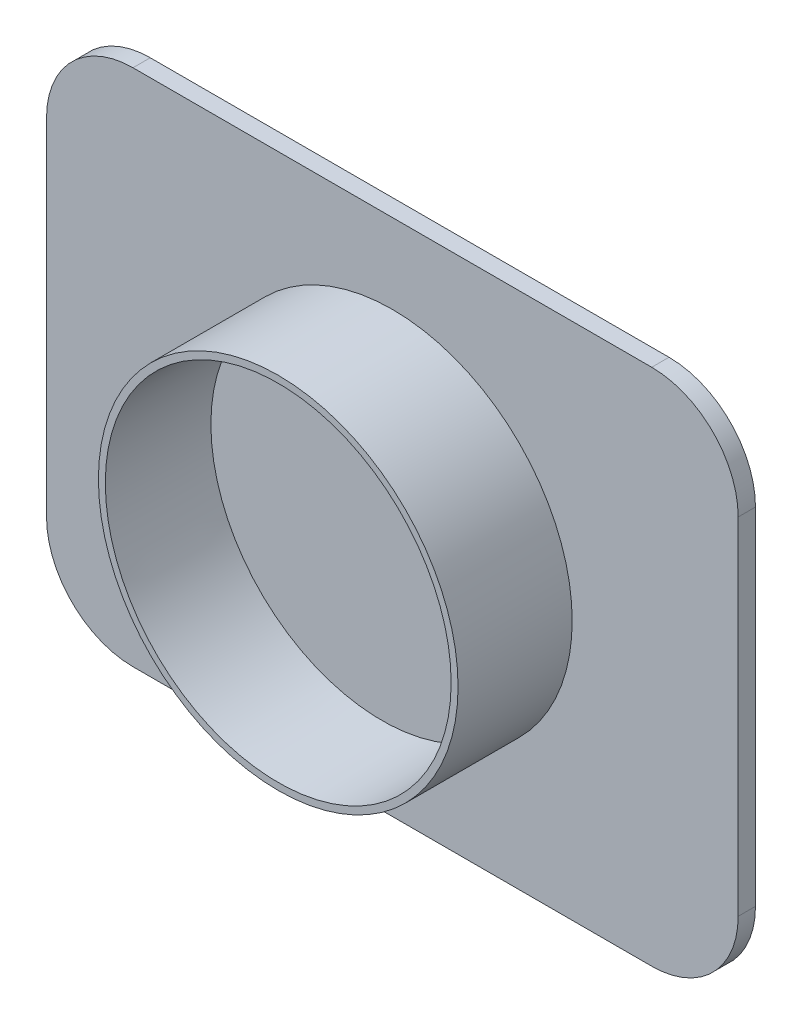
ISO-10303-21;
HEADER;
FILE_DESCRIPTION(('STEP AP214'),'2;1');
FILE_NAME('part.step','',(''),(''),'','','');
FILE_SCHEMA(('AUTOMOTIVE_DESIGN { 1 0 10303 214 1 1 1 1 }'));
ENDSEC;
DATA;
#1=APPLICATION_CONTEXT('core data for automotive mechanical design processes');
#2=APPLICATION_PROTOCOL_DEFINITION('international standard','automotive_design',2000,#1);
#3=PRODUCT_CONTEXT('',#1,'mechanical');
#4=PRODUCT('Part','Part','',(#3));
#5=PRODUCT_RELATED_PRODUCT_CATEGORY('part','',(#4));
#6=PRODUCT_DEFINITION_FORMATION('','',#4);
#7=PRODUCT_DEFINITION_CONTEXT('part definition',#1,'design');
#8=PRODUCT_DEFINITION('design','',#6,#7);
#9=PRODUCT_DEFINITION_SHAPE('','',#8);
#10=(LENGTH_UNIT() NAMED_UNIT(*) SI_UNIT(.MILLI.,.METRE.));
#11=(NAMED_UNIT(*) PLANE_ANGLE_UNIT() SI_UNIT($,.RADIAN.));
#12=(NAMED_UNIT(*) SI_UNIT($,.STERADIAN.) SOLID_ANGLE_UNIT());
#13=UNCERTAINTY_MEASURE_WITH_UNIT(LENGTH_MEASURE(1.E-05),#10,'distance_accuracy_value','');
#14=(GEOMETRIC_REPRESENTATION_CONTEXT(3) GLOBAL_UNCERTAINTY_ASSIGNED_CONTEXT((#13)) GLOBAL_UNIT_ASSIGNED_CONTEXT((#10,
#11,#12)) REPRESENTATION_CONTEXT('',''));
#15=CARTESIAN_POINT('',(0.,0.,0.));
#16=DIRECTION('',(0.,0.,1.));
#17=DIRECTION('',(1.,0.,0.));
#18=AXIS2_PLACEMENT_3D('',#15,#16,#17);
#19=CARTESIAN_POINT('',(0.,0.,6.6));
#20=DIRECTION('',(0.,0.,-1.));
#21=DIRECTION('',(-1.,0.,0.));
#22=AXIS2_PLACEMENT_3D('',#19,#20,#21);
#23=CYLINDRICAL_SURFACE('',#22,10.4);
#24=CARTESIAN_POINT('',(0.,0.,6.6));
#25=DIRECTION('',(0.,0.,1.));
#26=DIRECTION('',(1.,0.,0.));
#27=AXIS2_PLACEMENT_3D('',#24,#25,#26);
#28=CIRCLE('',#27,10.4);
#29=CARTESIAN_POINT('',(10.4,0.,6.6));
#30=VERTEX_POINT('',#29);
#31=EDGE_CURVE('E124',#30,#30,#28,.T.);
#32=ORIENTED_EDGE('',*,*,#31,.F.);
#33=EDGE_LOOP('',(#32));
#34=FACE_BOUND('',#33,.T.);
#35=CARTESIAN_POINT('',(0.,0.,0.));
#36=DIRECTION('',(0.,0.,1.));
#37=DIRECTION('',(1.,0.,0.));
#38=AXIS2_PLACEMENT_3D('',#35,#36,#37);
#39=CIRCLE('',#38,10.4);
#40=CARTESIAN_POINT('',(10.4,0.,0.));
#41=VERTEX_POINT('',#40);
#42=EDGE_CURVE('E132',#41,#41,#39,.T.);
#43=ORIENTED_EDGE('',*,*,#42,.T.);
#44=EDGE_LOOP('',(#43));
#45=FACE_BOUND('',#44,.T.);
#46=ADVANCED_FACE('F35',(#34,#45),#23,.T.);
#47=CARTESIAN_POINT('',(0.,0.,6.6));
#48=DIRECTION('',(0.,0.,1.));
#49=DIRECTION('',(1.,0.,0.));
#50=AXIS2_PLACEMENT_3D('',#47,#48,#49);
#51=PLANE('',#50);
#52=CARTESIAN_POINT('',(0.,0.,6.6));
#53=DIRECTION('',(0.,0.,1.));
#54=DIRECTION('',(1.,0.,0.));
#55=AXIS2_PLACEMENT_3D('',#52,#53,#54);
#56=CIRCLE('',#55,10.);
#57=CARTESIAN_POINT('',(10.,0.,6.6));
#58=VERTEX_POINT('',#57);
#59=EDGE_CURVE('E179',#58,#58,#56,.T.);
#60=ORIENTED_EDGE('',*,*,#59,.F.);
#61=EDGE_LOOP('',(#60));
#62=FACE_BOUND('',#61,.T.);
#63=ORIENTED_EDGE('',*,*,#31,.T.);
#64=EDGE_LOOP('',(#63));
#65=FACE_BOUND('',#64,.T.);
#66=ADVANCED_FACE('F190',(#62,#65),#51,.T.);
#67=CARTESIAN_POINT('',(0.,0.,6.6));
#68=DIRECTION('',(0.,0.,1.));
#69=DIRECTION('',(1.,0.,0.));
#70=AXIS2_PLACEMENT_3D('',#67,#68,#69);
#71=CONICAL_SURFACE('',#70,10.,0.0174532925199433);
#72=CARTESIAN_POINT('',(0.,0.,0.6));
#73=DIRECTION('',(0.,0.,1.));
#74=DIRECTION('',(1.,0.,0.));
#75=AXIS2_PLACEMENT_3D('',#72,#73,#74);
#76=CIRCLE('',#75,9.89526961043069);
#77=CARTESIAN_POINT('',(9.89526961043069,0.,0.6));
#78=VERTEX_POINT('',#77);
#79=EDGE_CURVE('E129',#78,#78,#76,.T.);
#80=ORIENTED_EDGE('',*,*,#79,.F.);
#81=EDGE_LOOP('',(#80));
#82=FACE_BOUND('',#81,.T.);
#83=ORIENTED_EDGE('',*,*,#59,.T.);
#84=EDGE_LOOP('',(#83));
#85=FACE_BOUND('',#84,.T.);
#86=ADVANCED_FACE('F187',(#82,#85),#71,.F.);
#87=CARTESIAN_POINT('',(0.,0.,0.6));
#88=DIRECTION('',(0.,0.,1.));
#89=DIRECTION('',(1.,0.,0.));
#90=AXIS2_PLACEMENT_3D('',#87,#88,#89);
#91=PLANE('',#90);
#92=ORIENTED_EDGE('',*,*,#79,.T.);
#93=EDGE_LOOP('',(#92));
#94=FACE_BOUND('',#93,.T.);
#95=ADVANCED_FACE('F185',(#94),#91,.T.);
#96=CARTESIAN_POINT('',(-20.,15.,-1.));
#97=DIRECTION('',(-1.,0.,0.));
#98=DIRECTION('',(0.,0.,1.));
#99=AXIS2_PLACEMENT_3D('',#96,#97,#98);
#100=PLANE('',#99);
#101=DIRECTION('',(0.,-1.,0.));
#102=VECTOR('',#101,1.);
#103=CARTESIAN_POINT('',(-20.,15.,-1.));
#104=LINE('',#103,#102);
#105=CARTESIAN_POINT('',(-20.,10.,-1.));
#106=VERTEX_POINT('',#105);
#107=CARTESIAN_POINT('',(-20.,-10.,-1.));
#108=VERTEX_POINT('',#107);
#109=EDGE_CURVE('E157',#106,#108,#104,.T.);
#110=ORIENTED_EDGE('',*,*,#109,.T.);
#111=DIRECTION('',(0.,0.,1.));
#112=VECTOR('',#111,1.);
#113=CARTESIAN_POINT('',(-20.,-10.,-1.));
#114=LINE('',#113,#112);
#115=CARTESIAN_POINT('',(-20.,-10.,0.));
#116=VERTEX_POINT('',#115);
#117=EDGE_CURVE('E11',#108,#116,#114,.T.);
#118=ORIENTED_EDGE('',*,*,#117,.T.);
#119=DIRECTION('',(0.,-1.,0.));
#120=VECTOR('',#119,1.);
#121=CARTESIAN_POINT('',(-20.,15.,0.));
#122=LINE('',#121,#120);
#123=CARTESIAN_POINT('',(-20.,10.,0.));
#124=VERTEX_POINT('',#123);
#125=EDGE_CURVE('E160',#124,#116,#122,.T.);
#126=ORIENTED_EDGE('',*,*,#125,.F.);
#127=DIRECTION('',(0.,0.,1.));
#128=VECTOR('',#127,1.);
#129=CARTESIAN_POINT('',(-20.,10.,-1.));
#130=LINE('',#129,#128);
#131=EDGE_CURVE('E43',#124,#106,#130,.F.);
#132=ORIENTED_EDGE('',*,*,#131,.T.);
#133=EDGE_LOOP('',(#110,#118,#126,#132));
#134=FACE_BOUND('',#133,.T.);
#135=ADVANCED_FACE('F156',(#134),#100,.T.);
#136=CARTESIAN_POINT('',(20.,15.,-1.));
#137=DIRECTION('',(0.,1.,0.));
#138=DIRECTION('',(-1.,0.,0.));
#139=AXIS2_PLACEMENT_3D('',#136,#137,#138);
#140=PLANE('',#139);
#141=DIRECTION('',(-1.,0.,0.));
#142=VECTOR('',#141,1.);
#143=CARTESIAN_POINT('',(20.,15.,0.));
#144=LINE('',#143,#142);
#145=CARTESIAN_POINT('',(15.,15.,0.));
#146=VERTEX_POINT('',#145);
#147=CARTESIAN_POINT('',(-15.,15.,0.));
#148=VERTEX_POINT('',#147);
#149=EDGE_CURVE('E121',#146,#148,#144,.T.);
#150=ORIENTED_EDGE('',*,*,#149,.F.);
#151=DIRECTION('',(0.,0.,1.));
#152=VECTOR('',#151,1.);
#153=CARTESIAN_POINT('',(15.,15.,-1.));
#154=LINE('',#153,#152);
#155=CARTESIAN_POINT('',(15.,15.,-1.));
#156=VERTEX_POINT('',#155);
#157=EDGE_CURVE('E140',#146,#156,#154,.F.);
#158=ORIENTED_EDGE('',*,*,#157,.T.);
#159=DIRECTION('',(-1.,0.,0.));
#160=VECTOR('',#159,1.);
#161=CARTESIAN_POINT('',(20.,15.,-1.));
#162=LINE('',#161,#160);
#163=CARTESIAN_POINT('',(-15.,15.,-1.));
#164=VERTEX_POINT('',#163);
#165=EDGE_CURVE('E175',#156,#164,#162,.T.);
#166=ORIENTED_EDGE('',*,*,#165,.T.);
#167=DIRECTION('',(0.,0.,1.));
#168=VECTOR('',#167,1.);
#169=CARTESIAN_POINT('',(-15.,15.,-1.));
#170=LINE('',#169,#168);
#171=EDGE_CURVE('E137',#164,#148,#170,.T.);
#172=ORIENTED_EDGE('',*,*,#171,.T.);
#173=EDGE_LOOP('',(#150,#158,#166,#172));
#174=FACE_BOUND('',#173,.T.);
#175=ADVANCED_FACE('F173',(#174),#140,.T.);
#176=CARTESIAN_POINT('',(20.,15.,-1.));
#177=DIRECTION('',(1.,0.,0.));
#178=DIRECTION('',(0.,1.,0.));
#179=AXIS2_PLACEMENT_3D('',#176,#177,#178);
#180=PLANE('',#179);
#181=DIRECTION('',(0.,1.,0.));
#182=VECTOR('',#181,1.);
#183=CARTESIAN_POINT('',(20.,15.,-1.));
#184=LINE('',#183,#182);
#185=CARTESIAN_POINT('',(20.,-9.99999999999998,-1.));
#186=VERTEX_POINT('',#185);
#187=CARTESIAN_POINT('',(20.,10.,-1.));
#188=VERTEX_POINT('',#187);
#189=EDGE_CURVE('E205',#186,#188,#184,.T.);
#190=ORIENTED_EDGE('',*,*,#189,.T.);
#191=DIRECTION('',(0.,0.,1.));
#192=VECTOR('',#191,1.);
#193=CARTESIAN_POINT('',(20.,10.,-1.));
#194=LINE('',#193,#192);
#195=CARTESIAN_POINT('',(20.,10.,0.));
#196=VERTEX_POINT('',#195);
#197=EDGE_CURVE('E120',#188,#196,#194,.T.);
#198=ORIENTED_EDGE('',*,*,#197,.T.);
#199=DIRECTION('',(0.,1.,0.));
#200=VECTOR('',#199,1.);
#201=CARTESIAN_POINT('',(20.,15.,0.));
#202=LINE('',#201,#200);
#203=CARTESIAN_POINT('',(20.,-9.99999999999998,0.));
#204=VERTEX_POINT('',#203);
#205=EDGE_CURVE('E105',#204,#196,#202,.T.);
#206=ORIENTED_EDGE('',*,*,#205,.F.);
#207=DIRECTION('',(0.,0.,1.));
#208=VECTOR('',#207,1.);
#209=CARTESIAN_POINT('',(20.,-9.99999999999999,-1.));
#210=LINE('',#209,#208);
#211=EDGE_CURVE('E118',#204,#186,#210,.F.);
#212=ORIENTED_EDGE('',*,*,#211,.T.);
#213=EDGE_LOOP('',(#190,#198,#206,#212));
#214=FACE_BOUND('',#213,.T.);
#215=ADVANCED_FACE('F117',(#214),#180,.T.);
#216=CARTESIAN_POINT('',(20.,-15.,-1.));
#217=DIRECTION('',(0.,-1.,0.));
#218=DIRECTION('',(1.,0.,0.));
#219=AXIS2_PLACEMENT_3D('',#216,#217,#218);
#220=PLANE('',#219);
#221=DIRECTION('',(1.,0.,0.));
#222=VECTOR('',#221,1.);
#223=CARTESIAN_POINT('',(20.,-15.,-1.));
#224=LINE('',#223,#222);
#225=CARTESIAN_POINT('',(-15.,-15.,-1.));
#226=VERTEX_POINT('',#225);
#227=CARTESIAN_POINT('',(15.,-15.,-1.));
#228=VERTEX_POINT('',#227);
#229=EDGE_CURVE('E167',#226,#228,#224,.T.);
#230=ORIENTED_EDGE('',*,*,#229,.T.);
#231=DIRECTION('',(0.,0.,1.));
#232=VECTOR('',#231,1.);
#233=CARTESIAN_POINT('',(15.,-15.,-1.));
#234=LINE('',#233,#232);
#235=CARTESIAN_POINT('',(15.,-15.,0.));
#236=VERTEX_POINT('',#235);
#237=EDGE_CURVE('E150',#228,#236,#234,.T.);
#238=ORIENTED_EDGE('',*,*,#237,.T.);
#239=DIRECTION('',(1.,0.,0.));
#240=VECTOR('',#239,1.);
#241=CARTESIAN_POINT('',(20.,-15.,0.));
#242=LINE('',#241,#240);
#243=CARTESIAN_POINT('',(-15.,-15.,0.));
#244=VERTEX_POINT('',#243);
#245=EDGE_CURVE('E106',#244,#236,#242,.T.);
#246=ORIENTED_EDGE('',*,*,#245,.F.);
#247=DIRECTION('',(0.,0.,1.));
#248=VECTOR('',#247,1.);
#249=CARTESIAN_POINT('',(-15.,-15.,-1.));
#250=LINE('',#249,#248);
#251=EDGE_CURVE('E57',#244,#226,#250,.F.);
#252=ORIENTED_EDGE('',*,*,#251,.T.);
#253=EDGE_LOOP('',(#230,#238,#246,#252));
#254=FACE_BOUND('',#253,.T.);
#255=ADVANCED_FACE('F211',(#254),#220,.T.);
#256=CARTESIAN_POINT('',(0.,0.,-1.));
#257=DIRECTION('',(0.,0.,-1.));
#258=DIRECTION('',(-1.,0.,0.));
#259=AXIS2_PLACEMENT_3D('',#256,#257,#258);
#260=PLANE('',#259);
#261=ORIENTED_EDGE('',*,*,#165,.F.);
#262=CARTESIAN_POINT('',(15.,10.,-1.));
#263=DIRECTION('',(0.,0.,-1.));
#264=DIRECTION('',(-1.,0.,0.));
#265=AXIS2_PLACEMENT_3D('',#262,#263,#264);
#266=CIRCLE('',#265,5.);
#267=EDGE_CURVE('E147',#156,#188,#266,.T.);
#268=ORIENTED_EDGE('',*,*,#267,.T.);
#269=ORIENTED_EDGE('',*,*,#189,.F.);
#270=CARTESIAN_POINT('',(15.,-9.99999999999999,-1.));
#271=DIRECTION('',(0.,0.,-1.));
#272=DIRECTION('',(-1.,0.,0.));
#273=AXIS2_PLACEMENT_3D('',#270,#271,#272);
#274=CIRCLE('',#273,5.);
#275=EDGE_CURVE('E50',#186,#228,#274,.T.);
#276=ORIENTED_EDGE('',*,*,#275,.T.);
#277=ORIENTED_EDGE('',*,*,#229,.F.);
#278=CARTESIAN_POINT('',(-15.,-10.,-1.));
#279=DIRECTION('',(0.,0.,-1.));
#280=DIRECTION('',(-1.,0.,0.));
#281=AXIS2_PLACEMENT_3D('',#278,#279,#280);
#282=CIRCLE('',#281,5.);
#283=EDGE_CURVE('E144',#226,#108,#282,.T.);
#284=ORIENTED_EDGE('',*,*,#283,.T.);
#285=ORIENTED_EDGE('',*,*,#109,.F.);
#286=CARTESIAN_POINT('',(-15.,10.,-1.));
#287=DIRECTION('',(0.,0.,-1.));
#288=DIRECTION('',(-1.,0.,0.));
#289=AXIS2_PLACEMENT_3D('',#286,#287,#288);
#290=CIRCLE('',#289,5.);
#291=EDGE_CURVE('E142',#106,#164,#290,.T.);
#292=ORIENTED_EDGE('',*,*,#291,.T.);
#293=EDGE_LOOP('',(#261,#268,#269,#276,#277,#284,#285,#292));
#294=FACE_BOUND('',#293,.T.);
#295=ADVANCED_FACE('F164',(#294),#260,.T.);
#296=CARTESIAN_POINT('',(0.,0.,0.));
#297=DIRECTION('',(0.,0.,-1.));
#298=DIRECTION('',(-1.,0.,0.));
#299=AXIS2_PLACEMENT_3D('',#296,#297,#298);
#300=PLANE('',#299);
#301=ORIENTED_EDGE('',*,*,#42,.F.);
#302=EDGE_LOOP('',(#301));
#303=FACE_BOUND('',#302,.T.);
#304=ORIENTED_EDGE('',*,*,#205,.T.);
#305=CARTESIAN_POINT('',(15.,10.,0.));
#306=DIRECTION('',(0.,0.,-1.));
#307=DIRECTION('',(-1.,0.,0.));
#308=AXIS2_PLACEMENT_3D('',#305,#306,#307);
#309=CIRCLE('',#308,5.);
#310=EDGE_CURVE('E111',#196,#146,#309,.F.);
#311=ORIENTED_EDGE('',*,*,#310,.T.);
#312=ORIENTED_EDGE('',*,*,#149,.T.);
#313=CARTESIAN_POINT('',(-15.,10.,0.));
#314=DIRECTION('',(0.,0.,-1.));
#315=DIRECTION('',(-1.,0.,0.));
#316=AXIS2_PLACEMENT_3D('',#313,#314,#315);
#317=CIRCLE('',#316,5.);
#318=EDGE_CURVE('E126',#148,#124,#317,.F.);
#319=ORIENTED_EDGE('',*,*,#318,.T.);
#320=ORIENTED_EDGE('',*,*,#125,.T.);
#321=CARTESIAN_POINT('',(-15.,-10.,0.));
#322=DIRECTION('',(0.,0.,-1.));
#323=DIRECTION('',(-1.,0.,0.));
#324=AXIS2_PLACEMENT_3D('',#321,#322,#323);
#325=CIRCLE('',#324,5.);
#326=EDGE_CURVE('E112',#116,#244,#325,.F.);
#327=ORIENTED_EDGE('',*,*,#326,.T.);
#328=ORIENTED_EDGE('',*,*,#245,.T.);
#329=CARTESIAN_POINT('',(15.,-9.99999999999999,0.));
#330=DIRECTION('',(0.,0.,-1.));
#331=DIRECTION('',(-1.,0.,0.));
#332=AXIS2_PLACEMENT_3D('',#329,#330,#331);
#333=CIRCLE('',#332,5.);
#334=EDGE_CURVE('E102',#236,#204,#333,.F.);
#335=ORIENTED_EDGE('',*,*,#334,.T.);
#336=EDGE_LOOP('',(#304,#311,#312,#319,#320,#327,#328,#335));
#337=FACE_BOUND('',#336,.T.);
#338=ADVANCED_FACE('F104',(#303,#337),#300,.F.);
#339=CARTESIAN_POINT('',(15.,10.,-1.));
#340=DIRECTION('',(0.,0.,1.));
#341=DIRECTION('',(1.,0.,0.));
#342=AXIS2_PLACEMENT_3D('',#339,#340,#341);
#343=CYLINDRICAL_SURFACE('',#342,5.);
#344=ORIENTED_EDGE('',*,*,#267,.F.);
#345=ORIENTED_EDGE('',*,*,#157,.F.);
#346=ORIENTED_EDGE('',*,*,#310,.F.);
#347=ORIENTED_EDGE('',*,*,#197,.F.);
#348=EDGE_LOOP('',(#344,#345,#346,#347));
#349=FACE_BOUND('',#348,.T.);
#350=ADVANCED_FACE('F218',(#349),#343,.T.);
#351=CARTESIAN_POINT('',(15.,-9.99999999999999,-1.));
#352=DIRECTION('',(0.,0.,1.));
#353=DIRECTION('',(1.,0.,0.));
#354=AXIS2_PLACEMENT_3D('',#351,#352,#353);
#355=CYLINDRICAL_SURFACE('',#354,5.);
#356=ORIENTED_EDGE('',*,*,#275,.F.);
#357=ORIENTED_EDGE('',*,*,#211,.F.);
#358=ORIENTED_EDGE('',*,*,#334,.F.);
#359=ORIENTED_EDGE('',*,*,#237,.F.);
#360=EDGE_LOOP('',(#356,#357,#358,#359));
#361=FACE_BOUND('',#360,.T.);
#362=ADVANCED_FACE('F123',(#361),#355,.T.);
#363=CARTESIAN_POINT('',(-15.,-10.,-1.));
#364=DIRECTION('',(0.,0.,1.));
#365=DIRECTION('',(1.,0.,0.));
#366=AXIS2_PLACEMENT_3D('',#363,#364,#365);
#367=CYLINDRICAL_SURFACE('',#366,5.);
#368=ORIENTED_EDGE('',*,*,#283,.F.);
#369=ORIENTED_EDGE('',*,*,#251,.F.);
#370=ORIENTED_EDGE('',*,*,#326,.F.);
#371=ORIENTED_EDGE('',*,*,#117,.F.);
#372=EDGE_LOOP('',(#368,#369,#370,#371));
#373=FACE_BOUND('',#372,.T.);
#374=ADVANCED_FACE('F212',(#373),#367,.T.);
#375=CARTESIAN_POINT('',(-15.,10.,-1.));
#376=DIRECTION('',(0.,0.,1.));
#377=DIRECTION('',(1.,0.,0.));
#378=AXIS2_PLACEMENT_3D('',#375,#376,#377);
#379=CYLINDRICAL_SURFACE('',#378,5.);
#380=ORIENTED_EDGE('',*,*,#291,.F.);
#381=ORIENTED_EDGE('',*,*,#131,.F.);
#382=ORIENTED_EDGE('',*,*,#318,.F.);
#383=ORIENTED_EDGE('',*,*,#171,.F.);
#384=EDGE_LOOP('',(#380,#381,#382,#383));
#385=FACE_BOUND('',#384,.T.);
#386=ADVANCED_FACE('F37',(#385),#379,.T.);
#387=CLOSED_SHELL('',(#46,#66,#86,#95,#135,#175,#215,#255,#295,#338,#350,#362,#374,#386));
#388=MANIFOLD_SOLID_BREP('B2',#387);
#389=ADVANCED_BREP_SHAPE_REPRESENTATION('',(#18,#388),#14);
#390=SHAPE_DEFINITION_REPRESENTATION(#9,#389);
ENDSEC;
END-ISO-10303-21;
